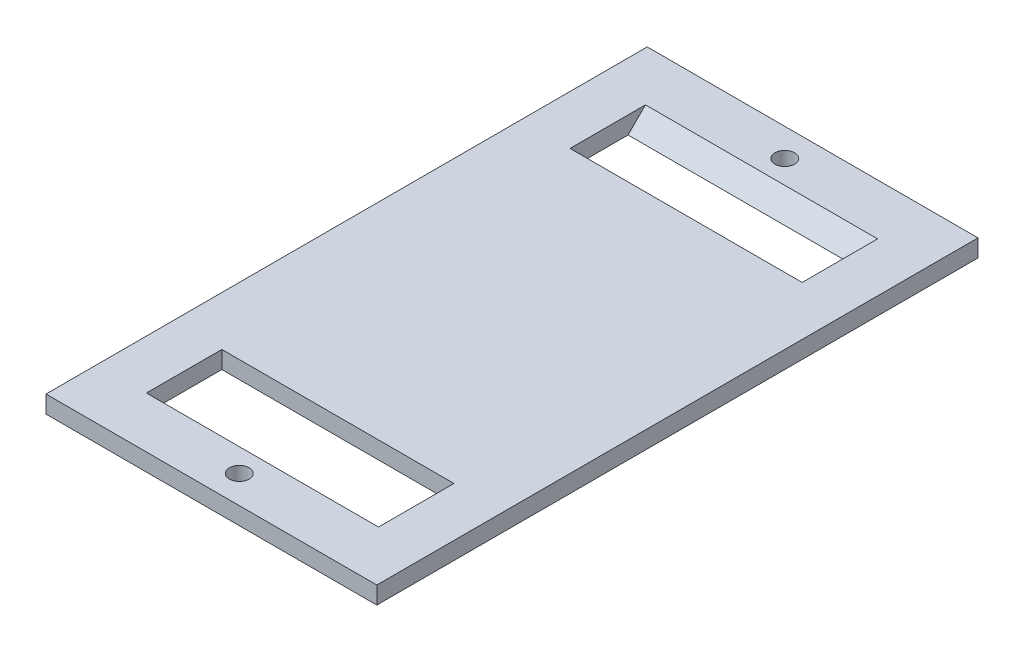
ISO-10303-21;
HEADER;
FILE_DESCRIPTION(('STEP AP214'),'2;1');
FILE_NAME('part.step','',(''),(''),'','','');
FILE_SCHEMA(('AUTOMOTIVE_DESIGN { 1 0 10303 214 1 1 1 1 }'));
ENDSEC;
DATA;
#1=APPLICATION_CONTEXT('core data for automotive mechanical design processes');
#2=APPLICATION_PROTOCOL_DEFINITION('international standard','automotive_design',2000,#1);
#3=PRODUCT_CONTEXT('',#1,'mechanical');
#4=PRODUCT('Part','Part','',(#3));
#5=PRODUCT_RELATED_PRODUCT_CATEGORY('part','',(#4));
#6=PRODUCT_DEFINITION_FORMATION('','',#4);
#7=PRODUCT_DEFINITION_CONTEXT('part definition',#1,'design');
#8=PRODUCT_DEFINITION('design','',#6,#7);
#9=PRODUCT_DEFINITION_SHAPE('','',#8);
#10=(LENGTH_UNIT() NAMED_UNIT(*) SI_UNIT(.MILLI.,.METRE.));
#11=(NAMED_UNIT(*) PLANE_ANGLE_UNIT() SI_UNIT($,.RADIAN.));
#12=(NAMED_UNIT(*) SI_UNIT($,.STERADIAN.) SOLID_ANGLE_UNIT());
#13=UNCERTAINTY_MEASURE_WITH_UNIT(LENGTH_MEASURE(1.E-05),#10,'distance_accuracy_value','');
#14=(GEOMETRIC_REPRESENTATION_CONTEXT(3) GLOBAL_UNCERTAINTY_ASSIGNED_CONTEXT((#13)) GLOBAL_UNIT_ASSIGNED_CONTEXT((#10,
#11,#12)) REPRESENTATION_CONTEXT('',''));
#15=CARTESIAN_POINT('',(0.,0.,0.));
#16=DIRECTION('',(0.,0.,1.));
#17=DIRECTION('',(1.,0.,0.));
#18=AXIS2_PLACEMENT_3D('',#15,#16,#17);
#19=CARTESIAN_POINT('',(0.,3.,0.));
#20=DIRECTION('',(0.,1.,0.));
#21=DIRECTION('',(0.,0.,1.));
#22=AXIS2_PLACEMENT_3D('',#19,#20,#21);
#23=PLANE('',#22);
#24=DIRECTION('',(0.,0.,-1.));
#25=VECTOR('',#24,1.);
#26=CARTESIAN_POINT('',(20.,3.,30.));
#27=LINE('',#26,#25);
#28=CARTESIAN_POINT('',(20.,3.,43.));
#29=VERTEX_POINT('',#28);
#30=CARTESIAN_POINT('',(20.,3.,30.));
#31=VERTEX_POINT('',#30);
#32=EDGE_CURVE('E50',#29,#31,#27,.T.);
#33=ORIENTED_EDGE('',*,*,#32,.F.);
#34=DIRECTION('',(-1.,0.,0.));
#35=VECTOR('',#34,1.);
#36=CARTESIAN_POINT('',(-20.,3.,43.));
#37=LINE('',#36,#35);
#38=CARTESIAN_POINT('',(-20.,3.,43.));
#39=VERTEX_POINT('',#38);
#40=EDGE_CURVE('E223',#29,#39,#37,.T.);
#41=ORIENTED_EDGE('',*,*,#40,.T.);
#42=DIRECTION('',(0.,0.,1.));
#43=VECTOR('',#42,1.);
#44=CARTESIAN_POINT('',(-20.,3.,30.));
#45=LINE('',#44,#43);
#46=CARTESIAN_POINT('',(-20.,3.,30.));
#47=VERTEX_POINT('',#46);
#48=EDGE_CURVE('E58',#47,#39,#45,.T.);
#49=ORIENTED_EDGE('',*,*,#48,.F.);
#50=DIRECTION('',(-1.,0.,0.));
#51=VECTOR('',#50,1.);
#52=CARTESIAN_POINT('',(-20.,3.,30.));
#53=LINE('',#52,#51);
#54=EDGE_CURVE('E146',#31,#47,#53,.T.);
#55=ORIENTED_EDGE('',*,*,#54,.F.);
#56=EDGE_LOOP('',(#33,#41,#49,#55));
#57=FACE_BOUND('',#56,.T.);
#58=DIRECTION('',(0.,0.,1.));
#59=VECTOR('',#58,1.);
#60=CARTESIAN_POINT('',(-20.,3.,-40.));
#61=LINE('',#60,#59);
#62=CARTESIAN_POINT('',(-20.,3.,-43.));
#63=VERTEX_POINT('',#62);
#64=CARTESIAN_POINT('',(-20.,3.,-30.));
#65=VERTEX_POINT('',#64);
#66=EDGE_CURVE('E170',#63,#65,#61,.T.);
#67=ORIENTED_EDGE('',*,*,#66,.F.);
#68=DIRECTION('',(1.,0.,0.));
#69=VECTOR('',#68,1.);
#70=CARTESIAN_POINT('',(20.,3.,-43.));
#71=LINE('',#70,#69);
#72=CARTESIAN_POINT('',(20.,3.,-43.));
#73=VERTEX_POINT('',#72);
#74=EDGE_CURVE('E220',#63,#73,#71,.T.);
#75=ORIENTED_EDGE('',*,*,#74,.T.);
#76=DIRECTION('',(0.,0.,-1.));
#77=VECTOR('',#76,1.);
#78=CARTESIAN_POINT('',(20.,3.,-40.));
#79=LINE('',#78,#77);
#80=CARTESIAN_POINT('',(20.,3.,-30.));
#81=VERTEX_POINT('',#80);
#82=EDGE_CURVE('E153',#81,#73,#79,.T.);
#83=ORIENTED_EDGE('',*,*,#82,.F.);
#84=DIRECTION('',(1.,0.,0.));
#85=VECTOR('',#84,1.);
#86=CARTESIAN_POINT('',(-20.,3.,-30.));
#87=LINE('',#86,#85);
#88=EDGE_CURVE('E159',#65,#81,#87,.T.);
#89=ORIENTED_EDGE('',*,*,#88,.F.);
#90=EDGE_LOOP('',(#67,#75,#83,#89));
#91=FACE_BOUND('',#90,.T.);
#92=CARTESIAN_POINT('',(0.,3.,-47.));
#93=DIRECTION('',(0.,1.,0.));
#94=DIRECTION('',(0.,0.,1.));
#95=AXIS2_PLACEMENT_3D('',#92,#93,#94);
#96=CIRCLE('',#95,1.7);
#97=CARTESIAN_POINT('',(0.,3.,-45.3));
#98=VERTEX_POINT('',#97);
#99=EDGE_CURVE('E185',#98,#98,#96,.T.);
#100=ORIENTED_EDGE('',*,*,#99,.F.);
#101=EDGE_LOOP('',(#100));
#102=FACE_BOUND('',#101,.T.);
#103=DIRECTION('',(0.,0.,-1.));
#104=VECTOR('',#103,1.);
#105=CARTESIAN_POINT('',(28.5,3.,-51.8));
#106=LINE('',#105,#104);
#107=CARTESIAN_POINT('',(28.5,3.,51.8));
#108=VERTEX_POINT('',#107);
#109=CARTESIAN_POINT('',(28.5,3.,-51.8));
#110=VERTEX_POINT('',#109);
#111=EDGE_CURVE('E191',#108,#110,#106,.T.);
#112=ORIENTED_EDGE('',*,*,#111,.T.);
#113=DIRECTION('',(-1.,0.,0.));
#114=VECTOR('',#113,1.);
#115=CARTESIAN_POINT('',(-28.5,3.,-51.8));
#116=LINE('',#115,#114);
#117=CARTESIAN_POINT('',(-28.5,3.,-51.8));
#118=VERTEX_POINT('',#117);
#119=EDGE_CURVE('E194',#110,#118,#116,.T.);
#120=ORIENTED_EDGE('',*,*,#119,.T.);
#121=DIRECTION('',(0.,0.,1.));
#122=VECTOR('',#121,1.);
#123=CARTESIAN_POINT('',(-28.5,3.,-51.8));
#124=LINE('',#123,#122);
#125=CARTESIAN_POINT('',(-28.5,3.,51.8));
#126=VERTEX_POINT('',#125);
#127=EDGE_CURVE('E197',#118,#126,#124,.T.);
#128=ORIENTED_EDGE('',*,*,#127,.T.);
#129=DIRECTION('',(1.,0.,0.));
#130=VECTOR('',#129,1.);
#131=CARTESIAN_POINT('',(-28.5,3.,51.8));
#132=LINE('',#131,#130);
#133=EDGE_CURVE('E199',#126,#108,#132,.T.);
#134=ORIENTED_EDGE('',*,*,#133,.T.);
#135=EDGE_LOOP('',(#112,#120,#128,#134));
#136=FACE_BOUND('',#135,.T.);
#137=CARTESIAN_POINT('',(0.,3.,47.));
#138=DIRECTION('',(0.,1.,0.));
#139=DIRECTION('',(0.,0.,1.));
#140=AXIS2_PLACEMENT_3D('',#137,#138,#139);
#141=CIRCLE('',#140,1.7);
#142=CARTESIAN_POINT('',(0.,3.,48.7));
#143=VERTEX_POINT('',#142);
#144=EDGE_CURVE('E179',#143,#143,#141,.T.);
#145=ORIENTED_EDGE('',*,*,#144,.F.);
#146=EDGE_LOOP('',(#145));
#147=FACE_BOUND('',#146,.T.);
#148=ADVANCED_FACE('F35',(#57,#91,#102,#136,#147),#23,.T.);
#149=CARTESIAN_POINT('',(0.,0.,0.));
#150=DIRECTION('',(0.,1.,0.));
#151=DIRECTION('',(0.,0.,1.));
#152=AXIS2_PLACEMENT_3D('',#149,#150,#151);
#153=PLANE('',#152);
#154=DIRECTION('',(1.,0.,0.));
#155=VECTOR('',#154,1.);
#156=CARTESIAN_POINT('',(-20.,0.,40.));
#157=LINE('',#156,#155);
#158=CARTESIAN_POINT('',(-20.,0.,40.));
#159=VERTEX_POINT('',#158);
#160=CARTESIAN_POINT('',(20.,0.,40.));
#161=VERTEX_POINT('',#160);
#162=EDGE_CURVE('E132',#159,#161,#157,.T.);
#163=ORIENTED_EDGE('',*,*,#162,.T.);
#164=DIRECTION('',(0.,0.,-1.));
#165=VECTOR('',#164,1.);
#166=CARTESIAN_POINT('',(20.,0.,30.));
#167=LINE('',#166,#165);
#168=CARTESIAN_POINT('',(20.,0.,30.));
#169=VERTEX_POINT('',#168);
#170=EDGE_CURVE('E127',#161,#169,#167,.T.);
#171=ORIENTED_EDGE('',*,*,#170,.T.);
#172=DIRECTION('',(-1.,0.,0.));
#173=VECTOR('',#172,1.);
#174=CARTESIAN_POINT('',(-20.,0.,30.));
#175=LINE('',#174,#173);
#176=CARTESIAN_POINT('',(-20.,0.,30.));
#177=VERTEX_POINT('',#176);
#178=EDGE_CURVE('E136',#169,#177,#175,.T.);
#179=ORIENTED_EDGE('',*,*,#178,.T.);
#180=DIRECTION('',(0.,0.,1.));
#181=VECTOR('',#180,1.);
#182=CARTESIAN_POINT('',(-20.,0.,30.));
#183=LINE('',#182,#181);
#184=EDGE_CURVE('E140',#177,#159,#183,.T.);
#185=ORIENTED_EDGE('',*,*,#184,.T.);
#186=EDGE_LOOP('',(#163,#171,#179,#185));
#187=FACE_BOUND('',#186,.T.);
#188=DIRECTION('',(1.,0.,0.));
#189=VECTOR('',#188,1.);
#190=CARTESIAN_POINT('',(-20.,0.,-30.));
#191=LINE('',#190,#189);
#192=CARTESIAN_POINT('',(-20.,0.,-30.));
#193=VERTEX_POINT('',#192);
#194=CARTESIAN_POINT('',(20.,0.,-30.));
#195=VERTEX_POINT('',#194);
#196=EDGE_CURVE('E165',#193,#195,#191,.T.);
#197=ORIENTED_EDGE('',*,*,#196,.T.);
#198=DIRECTION('',(0.,0.,-1.));
#199=VECTOR('',#198,1.);
#200=CARTESIAN_POINT('',(20.,0.,-40.));
#201=LINE('',#200,#199);
#202=CARTESIAN_POINT('',(20.,0.,-40.));
#203=VERTEX_POINT('',#202);
#204=EDGE_CURVE('E155',#195,#203,#201,.T.);
#205=ORIENTED_EDGE('',*,*,#204,.T.);
#206=DIRECTION('',(-1.,0.,0.));
#207=VECTOR('',#206,1.);
#208=CARTESIAN_POINT('',(-20.,0.,-40.));
#209=LINE('',#208,#207);
#210=CARTESIAN_POINT('',(-20.,0.,-40.));
#211=VERTEX_POINT('',#210);
#212=EDGE_CURVE('E158',#203,#211,#209,.T.);
#213=ORIENTED_EDGE('',*,*,#212,.T.);
#214=DIRECTION('',(0.,0.,1.));
#215=VECTOR('',#214,1.);
#216=CARTESIAN_POINT('',(-20.,0.,-40.));
#217=LINE('',#216,#215);
#218=EDGE_CURVE('E162',#211,#193,#217,.T.);
#219=ORIENTED_EDGE('',*,*,#218,.T.);
#220=EDGE_LOOP('',(#197,#205,#213,#219));
#221=FACE_BOUND('',#220,.T.);
#222=DIRECTION('',(0.,0.,-1.));
#223=VECTOR('',#222,1.);
#224=CARTESIAN_POINT('',(28.5,0.,-51.8));
#225=LINE('',#224,#223);
#226=CARTESIAN_POINT('',(28.5,0.,51.8));
#227=VERTEX_POINT('',#226);
#228=CARTESIAN_POINT('',(28.5,0.,-51.8));
#229=VERTEX_POINT('',#228);
#230=EDGE_CURVE('E188',#227,#229,#225,.T.);
#231=ORIENTED_EDGE('',*,*,#230,.F.);
#232=DIRECTION('',(1.,0.,0.));
#233=VECTOR('',#232,1.);
#234=CARTESIAN_POINT('',(-28.5,0.,51.8));
#235=LINE('',#234,#233);
#236=CARTESIAN_POINT('',(-28.5,0.,51.8));
#237=VERTEX_POINT('',#236);
#238=EDGE_CURVE('E195',#237,#227,#235,.T.);
#239=ORIENTED_EDGE('',*,*,#238,.F.);
#240=DIRECTION('',(0.,0.,1.));
#241=VECTOR('',#240,1.);
#242=CARTESIAN_POINT('',(-28.5,0.,-51.8));
#243=LINE('',#242,#241);
#244=CARTESIAN_POINT('',(-28.5,0.,-51.8));
#245=VERTEX_POINT('',#244);
#246=EDGE_CURVE('E206',#245,#237,#243,.T.);
#247=ORIENTED_EDGE('',*,*,#246,.F.);
#248=DIRECTION('',(-1.,0.,0.));
#249=VECTOR('',#248,1.);
#250=CARTESIAN_POINT('',(-28.5,0.,-51.8));
#251=LINE('',#250,#249);
#252=EDGE_CURVE('E204',#229,#245,#251,.T.);
#253=ORIENTED_EDGE('',*,*,#252,.F.);
#254=EDGE_LOOP('',(#231,#239,#247,#253));
#255=FACE_BOUND('',#254,.T.);
#256=CARTESIAN_POINT('',(0.,0.,-47.));
#257=DIRECTION('',(0.,1.,0.));
#258=DIRECTION('',(0.,0.,1.));
#259=AXIS2_PLACEMENT_3D('',#256,#257,#258);
#260=CIRCLE('',#259,1.7);
#261=CARTESIAN_POINT('',(0.,0.,-45.3));
#262=VERTEX_POINT('',#261);
#263=EDGE_CURVE('E182',#262,#262,#260,.T.);
#264=ORIENTED_EDGE('',*,*,#263,.T.);
#265=EDGE_LOOP('',(#264));
#266=FACE_BOUND('',#265,.T.);
#267=CARTESIAN_POINT('',(0.,0.,47.));
#268=DIRECTION('',(0.,1.,0.));
#269=DIRECTION('',(0.,0.,1.));
#270=AXIS2_PLACEMENT_3D('',#267,#268,#269);
#271=CIRCLE('',#270,1.7);
#272=CARTESIAN_POINT('',(0.,0.,48.7));
#273=VERTEX_POINT('',#272);
#274=EDGE_CURVE('E177',#273,#273,#271,.T.);
#275=ORIENTED_EDGE('',*,*,#274,.T.);
#276=EDGE_LOOP('',(#275));
#277=FACE_BOUND('',#276,.T.);
#278=ADVANCED_FACE('F142',(#187,#221,#255,#266,#277),#153,.F.);
#279=CARTESIAN_POINT('',(28.5,3.,-51.8));
#280=DIRECTION('',(-1.,0.,0.));
#281=DIRECTION('',(0.,0.,1.));
#282=AXIS2_PLACEMENT_3D('',#279,#280,#281);
#283=PLANE('',#282);
#284=ORIENTED_EDGE('',*,*,#230,.T.);
#285=DIRECTION('',(0.,-1.,0.));
#286=VECTOR('',#285,1.);
#287=CARTESIAN_POINT('',(28.5,3.,-51.8));
#288=LINE('',#287,#286);
#289=EDGE_CURVE('E217',#110,#229,#288,.T.);
#290=ORIENTED_EDGE('',*,*,#289,.F.);
#291=ORIENTED_EDGE('',*,*,#111,.F.);
#292=DIRECTION('',(0.,-1.,0.));
#293=VECTOR('',#292,1.);
#294=CARTESIAN_POINT('',(28.5,3.,51.8));
#295=LINE('',#294,#293);
#296=EDGE_CURVE('E201',#108,#227,#295,.T.);
#297=ORIENTED_EDGE('',*,*,#296,.T.);
#298=EDGE_LOOP('',(#284,#290,#291,#297));
#299=FACE_BOUND('',#298,.T.);
#300=ADVANCED_FACE('F264',(#299),#283,.F.);
#301=CARTESIAN_POINT('',(-28.5,3.,-51.8));
#302=DIRECTION('',(0.,0.,1.));
#303=DIRECTION('',(1.,0.,0.));
#304=AXIS2_PLACEMENT_3D('',#301,#302,#303);
#305=PLANE('',#304);
#306=ORIENTED_EDGE('',*,*,#252,.T.);
#307=DIRECTION('',(0.,-1.,0.));
#308=VECTOR('',#307,1.);
#309=CARTESIAN_POINT('',(-28.5,3.,-51.8));
#310=LINE('',#309,#308);
#311=EDGE_CURVE('E214',#118,#245,#310,.T.);
#312=ORIENTED_EDGE('',*,*,#311,.F.);
#313=ORIENTED_EDGE('',*,*,#119,.F.);
#314=ORIENTED_EDGE('',*,*,#289,.T.);
#315=EDGE_LOOP('',(#306,#312,#313,#314));
#316=FACE_BOUND('',#315,.T.);
#317=ADVANCED_FACE('F275',(#316),#305,.F.);
#318=CARTESIAN_POINT('',(-28.5,3.,-51.8));
#319=DIRECTION('',(1.,0.,0.));
#320=DIRECTION('',(0.,0.,-1.));
#321=AXIS2_PLACEMENT_3D('',#318,#319,#320);
#322=PLANE('',#321);
#323=ORIENTED_EDGE('',*,*,#246,.T.);
#324=DIRECTION('',(0.,-1.,0.));
#325=VECTOR('',#324,1.);
#326=CARTESIAN_POINT('',(-28.5,3.,51.8));
#327=LINE('',#326,#325);
#328=EDGE_CURVE('E211',#126,#237,#327,.T.);
#329=ORIENTED_EDGE('',*,*,#328,.F.);
#330=ORIENTED_EDGE('',*,*,#127,.F.);
#331=ORIENTED_EDGE('',*,*,#311,.T.);
#332=EDGE_LOOP('',(#323,#329,#330,#331));
#333=FACE_BOUND('',#332,.T.);
#334=ADVANCED_FACE('F271',(#333),#322,.F.);
#335=CARTESIAN_POINT('',(-28.5,3.,51.8));
#336=DIRECTION('',(0.,0.,-1.));
#337=DIRECTION('',(-1.,0.,0.));
#338=AXIS2_PLACEMENT_3D('',#335,#336,#337);
#339=PLANE('',#338);
#340=ORIENTED_EDGE('',*,*,#238,.T.);
#341=ORIENTED_EDGE('',*,*,#296,.F.);
#342=ORIENTED_EDGE('',*,*,#133,.F.);
#343=ORIENTED_EDGE('',*,*,#328,.T.);
#344=EDGE_LOOP('',(#340,#341,#342,#343));
#345=FACE_BOUND('',#344,.T.);
#346=ADVANCED_FACE('F268',(#345),#339,.F.);
#347=CARTESIAN_POINT('',(0.,3.,-47.));
#348=DIRECTION('',(0.,-1.,0.));
#349=DIRECTION('',(0.,0.,-1.));
#350=AXIS2_PLACEMENT_3D('',#347,#348,#349);
#351=CYLINDRICAL_SURFACE('',#350,1.7);
#352=ORIENTED_EDGE('',*,*,#99,.T.);
#353=EDGE_LOOP('',(#352));
#354=FACE_BOUND('',#353,.T.);
#355=ORIENTED_EDGE('',*,*,#263,.F.);
#356=EDGE_LOOP('',(#355));
#357=FACE_BOUND('',#356,.T.);
#358=ADVANCED_FACE('F255',(#354,#357),#351,.F.);
#359=CARTESIAN_POINT('',(0.,3.,47.));
#360=DIRECTION('',(0.,-1.,0.));
#361=DIRECTION('',(0.,0.,-1.));
#362=AXIS2_PLACEMENT_3D('',#359,#360,#361);
#363=CYLINDRICAL_SURFACE('',#362,1.7);
#364=ORIENTED_EDGE('',*,*,#144,.T.);
#365=EDGE_LOOP('',(#364));
#366=FACE_BOUND('',#365,.T.);
#367=ORIENTED_EDGE('',*,*,#274,.F.);
#368=EDGE_LOOP('',(#367));
#369=FACE_BOUND('',#368,.T.);
#370=ADVANCED_FACE('F248',(#366,#369),#363,.F.);
#371=CARTESIAN_POINT('',(20.,0.,-40.));
#372=DIRECTION('',(1.,0.,0.));
#373=DIRECTION('',(0.,0.,-1.));
#374=AXIS2_PLACEMENT_3D('',#371,#372,#373);
#375=PLANE('',#374);
#376=ORIENTED_EDGE('',*,*,#82,.T.);
#377=DIRECTION('',(0.,-0.707106781186548,0.707106781186548));
#378=VECTOR('',#377,1.);
#379=CARTESIAN_POINT('',(20.,0.,-40.));
#380=LINE('',#379,#378);
#381=EDGE_CURVE('E11',#73,#203,#380,.T.);
#382=ORIENTED_EDGE('',*,*,#381,.T.);
#383=ORIENTED_EDGE('',*,*,#204,.F.);
#384=DIRECTION('',(0.,1.,0.));
#385=VECTOR('',#384,1.);
#386=CARTESIAN_POINT('',(20.,0.,-30.));
#387=LINE('',#386,#385);
#388=EDGE_CURVE('E175',#195,#81,#387,.T.);
#389=ORIENTED_EDGE('',*,*,#388,.T.);
#390=EDGE_LOOP('',(#376,#382,#383,#389));
#391=FACE_BOUND('',#390,.T.);
#392=ADVANCED_FACE('F246',(#391),#375,.F.);
#393=CARTESIAN_POINT('',(-20.,0.,-30.));
#394=DIRECTION('',(0.,0.,1.));
#395=DIRECTION('',(1.,0.,0.));
#396=AXIS2_PLACEMENT_3D('',#393,#394,#395);
#397=PLANE('',#396);
#398=ORIENTED_EDGE('',*,*,#88,.T.);
#399=ORIENTED_EDGE('',*,*,#388,.F.);
#400=ORIENTED_EDGE('',*,*,#196,.F.);
#401=DIRECTION('',(0.,1.,0.));
#402=VECTOR('',#401,1.);
#403=CARTESIAN_POINT('',(-20.,0.,-30.));
#404=LINE('',#403,#402);
#405=EDGE_CURVE('E168',#193,#65,#404,.T.);
#406=ORIENTED_EDGE('',*,*,#405,.T.);
#407=EDGE_LOOP('',(#398,#399,#400,#406));
#408=FACE_BOUND('',#407,.T.);
#409=ADVANCED_FACE('F241',(#408),#397,.F.);
#410=CARTESIAN_POINT('',(-20.,0.,-40.));
#411=DIRECTION('',(-1.,0.,0.));
#412=DIRECTION('',(0.,0.,1.));
#413=AXIS2_PLACEMENT_3D('',#410,#411,#412);
#414=PLANE('',#413);
#415=ORIENTED_EDGE('',*,*,#66,.T.);
#416=ORIENTED_EDGE('',*,*,#405,.F.);
#417=ORIENTED_EDGE('',*,*,#218,.F.);
#418=DIRECTION('',(0.,0.707106781186548,-0.707106781186548));
#419=VECTOR('',#418,1.);
#420=CARTESIAN_POINT('',(-20.,0.,-40.));
#421=LINE('',#420,#419);
#422=EDGE_CURVE('E43',#211,#63,#421,.T.);
#423=ORIENTED_EDGE('',*,*,#422,.T.);
#424=EDGE_LOOP('',(#415,#416,#417,#423));
#425=FACE_BOUND('',#424,.T.);
#426=ADVANCED_FACE('F232',(#425),#414,.F.);
#427=CARTESIAN_POINT('',(20.,0.,30.));
#428=DIRECTION('',(1.,0.,0.));
#429=DIRECTION('',(0.,0.,-1.));
#430=AXIS2_PLACEMENT_3D('',#427,#428,#429);
#431=PLANE('',#430);
#432=ORIENTED_EDGE('',*,*,#32,.T.);
#433=DIRECTION('',(0.,1.,0.));
#434=VECTOR('',#433,1.);
#435=CARTESIAN_POINT('',(20.,0.,30.));
#436=LINE('',#435,#434);
#437=EDGE_CURVE('E123',#169,#31,#436,.T.);
#438=ORIENTED_EDGE('',*,*,#437,.F.);
#439=ORIENTED_EDGE('',*,*,#170,.F.);
#440=DIRECTION('',(0.,0.707106781186546,0.707106781186549));
#441=VECTOR('',#440,1.);
#442=CARTESIAN_POINT('',(20.,-4.99999999999999,35.));
#443=LINE('',#442,#441);
#444=EDGE_CURVE('E225',#161,#29,#443,.T.);
#445=ORIENTED_EDGE('',*,*,#444,.T.);
#446=EDGE_LOOP('',(#432,#438,#439,#445));
#447=FACE_BOUND('',#446,.T.);
#448=ADVANCED_FACE('F125',(#447),#431,.F.);
#449=CARTESIAN_POINT('',(-20.,0.,30.));
#450=DIRECTION('',(-1.,0.,0.));
#451=DIRECTION('',(0.,0.,1.));
#452=AXIS2_PLACEMENT_3D('',#449,#450,#451);
#453=PLANE('',#452);
#454=ORIENTED_EDGE('',*,*,#48,.T.);
#455=DIRECTION('',(0.,-0.707106781186546,-0.707106781186549));
#456=VECTOR('',#455,1.);
#457=CARTESIAN_POINT('',(-20.,-4.99999999999999,35.));
#458=LINE('',#457,#456);
#459=EDGE_CURVE('E227',#39,#159,#458,.T.);
#460=ORIENTED_EDGE('',*,*,#459,.T.);
#461=ORIENTED_EDGE('',*,*,#184,.F.);
#462=DIRECTION('',(0.,1.,0.));
#463=VECTOR('',#462,1.);
#464=CARTESIAN_POINT('',(-20.,0.,30.));
#465=LINE('',#464,#463);
#466=EDGE_CURVE('E131',#177,#47,#465,.T.);
#467=ORIENTED_EDGE('',*,*,#466,.T.);
#468=EDGE_LOOP('',(#454,#460,#461,#467));
#469=FACE_BOUND('',#468,.T.);
#470=ADVANCED_FACE('F289',(#469),#453,.F.);
#471=CARTESIAN_POINT('',(-20.,0.,30.));
#472=DIRECTION('',(0.,0.,-1.));
#473=DIRECTION('',(-1.,0.,0.));
#474=AXIS2_PLACEMENT_3D('',#471,#472,#473);
#475=PLANE('',#474);
#476=ORIENTED_EDGE('',*,*,#54,.T.);
#477=ORIENTED_EDGE('',*,*,#466,.F.);
#478=ORIENTED_EDGE('',*,*,#178,.F.);
#479=ORIENTED_EDGE('',*,*,#437,.T.);
#480=EDGE_LOOP('',(#476,#477,#478,#479));
#481=FACE_BOUND('',#480,.T.);
#482=ADVANCED_FACE('F137',(#481),#475,.F.);
#483=CARTESIAN_POINT('',(-20.,0.,40.));
#484=DIRECTION('',(0.,0.707106781186549,-0.707106781186546));
#485=DIRECTION('',(-1.,0.,0.));
#486=AXIS2_PLACEMENT_3D('',#483,#484,#485);
#487=PLANE('',#486);
#488=ORIENTED_EDGE('',*,*,#459,.F.);
#489=ORIENTED_EDGE('',*,*,#40,.F.);
#490=ORIENTED_EDGE('',*,*,#444,.F.);
#491=ORIENTED_EDGE('',*,*,#162,.F.);
#492=EDGE_LOOP('',(#488,#489,#490,#491));
#493=FACE_BOUND('',#492,.T.);
#494=ADVANCED_FACE('F282',(#493),#487,.T.);
#495=CARTESIAN_POINT('',(-20.,0.,-40.));
#496=DIRECTION('',(0.,0.707106781186548,0.707106781186548));
#497=DIRECTION('',(1.,0.,0.));
#498=AXIS2_PLACEMENT_3D('',#495,#496,#497);
#499=PLANE('',#498);
#500=ORIENTED_EDGE('',*,*,#381,.F.);
#501=ORIENTED_EDGE('',*,*,#74,.F.);
#502=ORIENTED_EDGE('',*,*,#422,.F.);
#503=ORIENTED_EDGE('',*,*,#212,.F.);
#504=EDGE_LOOP('',(#500,#501,#502,#503));
#505=FACE_BOUND('',#504,.T.);
#506=ADVANCED_FACE('F37',(#505),#499,.T.);
#507=CLOSED_SHELL('',(#148,#278,#300,#317,#334,#346,#358,#370,#392,#409,#426,#448,#470,#482,
#494,#506));
#508=MANIFOLD_SOLID_BREP('B2',#507);
#509=ADVANCED_BREP_SHAPE_REPRESENTATION('',(#18,#508),#14);
#510=SHAPE_DEFINITION_REPRESENTATION(#9,#509);
ENDSEC;
END-ISO-10303-21;
